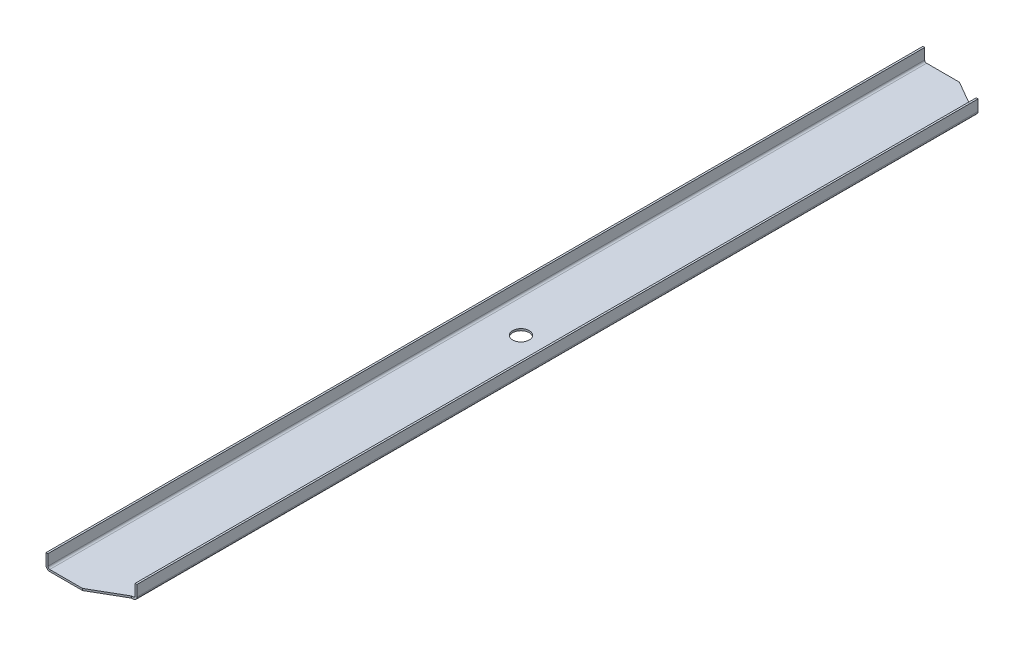
ISO-10303-21;
HEADER;
FILE_DESCRIPTION(('STEP AP214'),'2;1');
FILE_NAME('part.step','',(''),(''),'','','');
FILE_SCHEMA(('AUTOMOTIVE_DESIGN { 1 0 10303 214 1 1 1 1 }'));
ENDSEC;
DATA;
#1=APPLICATION_CONTEXT('core data for automotive mechanical design processes');
#2=APPLICATION_PROTOCOL_DEFINITION('international standard','automotive_design',2000,#1);
#3=PRODUCT_CONTEXT('',#1,'mechanical');
#4=PRODUCT('Part','Part','',(#3));
#5=PRODUCT_RELATED_PRODUCT_CATEGORY('part','',(#4));
#6=PRODUCT_DEFINITION_FORMATION('','',#4);
#7=PRODUCT_DEFINITION_CONTEXT('part definition',#1,'design');
#8=PRODUCT_DEFINITION('design','',#6,#7);
#9=PRODUCT_DEFINITION_SHAPE('','',#8);
#10=(LENGTH_UNIT() NAMED_UNIT(*) SI_UNIT(.MILLI.,.METRE.));
#11=(NAMED_UNIT(*) PLANE_ANGLE_UNIT() SI_UNIT($,.RADIAN.));
#12=(NAMED_UNIT(*) SI_UNIT($,.STERADIAN.) SOLID_ANGLE_UNIT());
#13=UNCERTAINTY_MEASURE_WITH_UNIT(LENGTH_MEASURE(1.E-05),#10,'distance_accuracy_value','');
#14=(GEOMETRIC_REPRESENTATION_CONTEXT(3) GLOBAL_UNCERTAINTY_ASSIGNED_CONTEXT((#13)) GLOBAL_UNIT_ASSIGNED_CONTEXT((#10,
#11,#12)) REPRESENTATION_CONTEXT('',''));
#15=CARTESIAN_POINT('',(0.,0.,0.));
#16=DIRECTION('',(0.,0.,1.));
#17=DIRECTION('',(1.,0.,0.));
#18=AXIS2_PLACEMENT_3D('',#15,#16,#17);
#19=CARTESIAN_POINT('',(60.2488,0.,-730.837519220438));
#20=DIRECTION('',(1.,0.,0.));
#21=DIRECTION('',(0.,0.,-1.));
#22=AXIS2_PLACEMENT_3D('',#19,#20,#21);
#23=PLANE('',#22);
#24=DIRECTION('',(0.,1.,0.));
#25=VECTOR('',#24,1.);
#26=CARTESIAN_POINT('',(60.2488,15.9512,730.837519220438));
#27=LINE('',#26,#25);
#28=CARTESIAN_POINT('',(60.2488,25.4,730.837519220438));
#29=VERTEX_POINT('',#28);
#30=CARTESIAN_POINT('',(60.2488,6.5024,730.837519220438));
#31=VERTEX_POINT('',#30);
#32=EDGE_CURVE('E96',#29,#31,#27,.F.);
#33=ORIENTED_EDGE('',*,*,#32,.F.);
#34=DIRECTION('',(0.,0.,1.));
#35=VECTOR('',#34,1.);
#36=CARTESIAN_POINT('',(60.2488,25.4,0.));
#37=LINE('',#36,#35);
#38=CARTESIAN_POINT('',(60.2488,25.4,-730.837519220438));
#39=VERTEX_POINT('',#38);
#40=EDGE_CURVE('E119',#39,#29,#37,.T.);
#41=ORIENTED_EDGE('',*,*,#40,.F.);
#42=DIRECTION('',(0.,1.,0.));
#43=VECTOR('',#42,1.);
#44=CARTESIAN_POINT('',(60.2488,15.9512,-730.837519220438));
#45=LINE('',#44,#43);
#46=CARTESIAN_POINT('',(60.2488,6.5024,-730.837519220438));
#47=VERTEX_POINT('',#46);
#48=EDGE_CURVE('E124',#47,#39,#45,.T.);
#49=ORIENTED_EDGE('',*,*,#48,.F.);
#50=DIRECTION('',(0.,0.,-1.));
#51=VECTOR('',#50,1.);
#52=CARTESIAN_POINT('',(60.2488,6.5024,730.837519220438));
#53=LINE('',#52,#51);
#54=EDGE_CURVE('E213',#47,#31,#53,.F.);
#55=ORIENTED_EDGE('',*,*,#54,.T.);
#56=EDGE_LOOP('',(#33,#41,#49,#55));
#57=FACE_BOUND('',#56,.T.);
#58=ADVANCED_FACE('F17',(#57),#23,.F.);
#59=CARTESIAN_POINT('',(-60.2488,0.,762.));
#60=DIRECTION('',(-1.,0.,0.));
#61=DIRECTION('',(0.,0.,1.));
#62=AXIS2_PLACEMENT_3D('',#59,#60,#61);
#63=PLANE('',#62);
#64=DIRECTION('',(0.,1.,0.));
#65=VECTOR('',#64,1.);
#66=CARTESIAN_POINT('',(-60.2488,15.9512,-762.));
#67=LINE('',#66,#65);
#68=CARTESIAN_POINT('',(-60.2488,25.4,-762.));
#69=VERTEX_POINT('',#68);
#70=CARTESIAN_POINT('',(-60.2488,6.5024,-762.));
#71=VERTEX_POINT('',#70);
#72=EDGE_CURVE('E216',#69,#71,#67,.F.);
#73=ORIENTED_EDGE('',*,*,#72,.F.);
#74=DIRECTION('',(0.,0.,1.));
#75=VECTOR('',#74,1.);
#76=CARTESIAN_POINT('',(-60.2488,25.4,0.));
#77=LINE('',#76,#75);
#78=CARTESIAN_POINT('',(-60.2488,25.4,762.));
#79=VERTEX_POINT('',#78);
#80=EDGE_CURVE('E139',#79,#69,#77,.F.);
#81=ORIENTED_EDGE('',*,*,#80,.F.);
#82=DIRECTION('',(0.,1.,0.));
#83=VECTOR('',#82,1.);
#84=CARTESIAN_POINT('',(-60.2488,15.9512,762.));
#85=LINE('',#84,#83);
#86=CARTESIAN_POINT('',(-60.2488,6.5024,762.));
#87=VERTEX_POINT('',#86);
#88=EDGE_CURVE('E106',#87,#79,#85,.T.);
#89=ORIENTED_EDGE('',*,*,#88,.F.);
#90=DIRECTION('',(0.,0.,1.));
#91=VECTOR('',#90,1.);
#92=CARTESIAN_POINT('',(-60.2488,6.5024,-762.));
#93=LINE('',#92,#91);
#94=EDGE_CURVE('E210',#87,#71,#93,.F.);
#95=ORIENTED_EDGE('',*,*,#94,.T.);
#96=EDGE_LOOP('',(#73,#81,#89,#95));
#97=FACE_BOUND('',#96,.T.);
#98=ADVANCED_FACE('F398',(#97),#63,.F.);
#99=CARTESIAN_POINT('',(61.8744,25.4,0.));
#100=DIRECTION('',(0.,1.,0.));
#101=DIRECTION('',(0.,0.,1.));
#102=AXIS2_PLACEMENT_3D('',#99,#100,#101);
#103=PLANE('',#102);
#104=DIRECTION('',(1.,0.,0.));
#105=VECTOR('',#104,1.);
#106=CARTESIAN_POINT('',(61.8744,25.4,730.837519220438));
#107=LINE('',#106,#105);
#108=CARTESIAN_POINT('',(63.5,25.4,730.837519220438));
#109=VERTEX_POINT('',#108);
#110=EDGE_CURVE('E134',#109,#29,#107,.F.);
#111=ORIENTED_EDGE('',*,*,#110,.F.);
#112=DIRECTION('',(0.,0.,-1.));
#113=VECTOR('',#112,1.);
#114=CARTESIAN_POINT('',(63.5,25.4,-730.837519220438));
#115=LINE('',#114,#113);
#116=CARTESIAN_POINT('',(63.5,25.4,-730.837519220438));
#117=VERTEX_POINT('',#116);
#118=EDGE_CURVE('E138',#117,#109,#115,.F.);
#119=ORIENTED_EDGE('',*,*,#118,.F.);
#120=DIRECTION('',(-1.,0.,0.));
#121=VECTOR('',#120,1.);
#122=CARTESIAN_POINT('',(61.8744,25.4,-730.837519220438));
#123=LINE('',#122,#121);
#124=EDGE_CURVE('E128',#39,#117,#123,.F.);
#125=ORIENTED_EDGE('',*,*,#124,.F.);
#126=ORIENTED_EDGE('',*,*,#40,.T.);
#127=EDGE_LOOP('',(#111,#119,#125,#126));
#128=FACE_BOUND('',#127,.T.);
#129=ADVANCED_FACE('F137',(#128),#103,.T.);
#130=CARTESIAN_POINT('',(-61.8744,25.4,0.));
#131=DIRECTION('',(0.,1.,0.));
#132=DIRECTION('',(0.,0.,1.));
#133=AXIS2_PLACEMENT_3D('',#130,#131,#132);
#134=PLANE('',#133);
#135=DIRECTION('',(-1.,0.,0.));
#136=VECTOR('',#135,1.);
#137=CARTESIAN_POINT('',(-61.8744,25.4,-762.));
#138=LINE('',#137,#136);
#139=CARTESIAN_POINT('',(-63.5,25.4,-762.));
#140=VERTEX_POINT('',#139);
#141=EDGE_CURVE('E141',#140,#69,#138,.F.);
#142=ORIENTED_EDGE('',*,*,#141,.F.);
#143=DIRECTION('',(0.,0.,1.));
#144=VECTOR('',#143,1.);
#145=CARTESIAN_POINT('',(-63.5,25.4,762.));
#146=LINE('',#145,#144);
#147=CARTESIAN_POINT('',(-63.5,25.4,762.));
#148=VERTEX_POINT('',#147);
#149=EDGE_CURVE('E184',#148,#140,#146,.F.);
#150=ORIENTED_EDGE('',*,*,#149,.F.);
#151=DIRECTION('',(1.,0.,0.));
#152=VECTOR('',#151,1.);
#153=CARTESIAN_POINT('',(-61.8744,25.4,762.));
#154=LINE('',#153,#152);
#155=EDGE_CURVE('E215',#79,#148,#154,.F.);
#156=ORIENTED_EDGE('',*,*,#155,.F.);
#157=ORIENTED_EDGE('',*,*,#80,.T.);
#158=EDGE_LOOP('',(#142,#150,#156,#157));
#159=FACE_BOUND('',#158,.T.);
#160=ADVANCED_FACE('F262',(#159),#134,.T.);
#161=CARTESIAN_POINT('',(56.9976,6.5024,730.837519220438));
#162=DIRECTION('',(0.,0.,-1.));
#163=DIRECTION('',(-1.,0.,0.));
#164=AXIS2_PLACEMENT_3D('',#161,#162,#163);
#165=CYLINDRICAL_SURFACE('',#164,3.2512);
#166=DIRECTION('',(0.,0.,1.));
#167=VECTOR('',#166,1.);
#168=CARTESIAN_POINT('',(56.9976,3.2512,0.));
#169=LINE('',#168,#167);
#170=CARTESIAN_POINT('',(56.9976,3.2512,730.837519220438));
#171=VERTEX_POINT('',#170);
#172=CARTESIAN_POINT('',(56.9976,3.2512,-730.837519220438));
#173=VERTEX_POINT('',#172);
#174=EDGE_CURVE('E181',#171,#173,#169,.F.);
#175=ORIENTED_EDGE('',*,*,#174,.F.);
#176=CARTESIAN_POINT('',(56.9976,6.5024,730.837519220438));
#177=DIRECTION('',(0.,0.,-1.));
#178=DIRECTION('',(-1.,0.,0.));
#179=AXIS2_PLACEMENT_3D('',#176,#177,#178);
#180=CIRCLE('',#179,3.2512);
#181=EDGE_CURVE('E20',#31,#171,#180,.T.);
#182=ORIENTED_EDGE('',*,*,#181,.F.);
#183=ORIENTED_EDGE('',*,*,#54,.F.);
#184=CARTESIAN_POINT('',(56.9976,6.5024,-730.837519220438));
#185=DIRECTION('',(0.,0.,-1.));
#186=DIRECTION('',(-1.,0.,0.));
#187=AXIS2_PLACEMENT_3D('',#184,#185,#186);
#188=CIRCLE('',#187,3.2512);
#189=EDGE_CURVE('E131',#47,#173,#188,.T.);
#190=ORIENTED_EDGE('',*,*,#189,.T.);
#191=EDGE_LOOP('',(#175,#182,#183,#190));
#192=FACE_BOUND('',#191,.T.);
#193=ADVANCED_FACE('F235',(#192),#165,.F.);
#194=CARTESIAN_POINT('',(-56.9976,6.5024,-762.));
#195=DIRECTION('',(0.,0.,1.));
#196=DIRECTION('',(1.,0.,0.));
#197=AXIS2_PLACEMENT_3D('',#194,#195,#196);
#198=CYLINDRICAL_SURFACE('',#197,3.2512);
#199=DIRECTION('',(0.,0.,1.));
#200=VECTOR('',#199,1.);
#201=CARTESIAN_POINT('',(-56.9976,3.2512,0.));
#202=LINE('',#201,#200);
#203=CARTESIAN_POINT('',(-56.9976,3.2512,-762.));
#204=VERTEX_POINT('',#203);
#205=CARTESIAN_POINT('',(-56.9976,3.2512,762.));
#206=VERTEX_POINT('',#205);
#207=EDGE_CURVE('E310',#204,#206,#202,.T.);
#208=ORIENTED_EDGE('',*,*,#207,.F.);
#209=CARTESIAN_POINT('',(-56.9976,6.5024,-762.));
#210=DIRECTION('',(0.,0.,1.));
#211=DIRECTION('',(1.,0.,0.));
#212=AXIS2_PLACEMENT_3D('',#209,#210,#211);
#213=CIRCLE('',#212,3.2512);
#214=EDGE_CURVE('E183',#71,#204,#213,.T.);
#215=ORIENTED_EDGE('',*,*,#214,.F.);
#216=ORIENTED_EDGE('',*,*,#94,.F.);
#217=CARTESIAN_POINT('',(-56.9976,6.5024,762.));
#218=DIRECTION('',(0.,0.,1.));
#219=DIRECTION('',(1.,0.,0.));
#220=AXIS2_PLACEMENT_3D('',#217,#218,#219);
#221=CIRCLE('',#220,3.2512);
#222=EDGE_CURVE('E178',#87,#206,#221,.T.);
#223=ORIENTED_EDGE('',*,*,#222,.T.);
#224=EDGE_LOOP('',(#208,#215,#216,#223));
#225=FACE_BOUND('',#224,.T.);
#226=ADVANCED_FACE('F347',(#225),#198,.F.);
#227=CARTESIAN_POINT('',(63.5,0.,-730.837519220438));
#228=DIRECTION('',(1.,0.,0.));
#229=DIRECTION('',(0.,0.,-1.));
#230=AXIS2_PLACEMENT_3D('',#227,#228,#229);
#231=PLANE('',#230);
#232=DIRECTION('',(0.,0.,-1.));
#233=VECTOR('',#232,1.);
#234=CARTESIAN_POINT('',(63.5,6.5024,730.837519220438));
#235=LINE('',#234,#233);
#236=CARTESIAN_POINT('',(63.5,6.5024,-730.837519220438));
#237=VERTEX_POINT('',#236);
#238=CARTESIAN_POINT('',(63.5,6.5024,730.837519220438));
#239=VERTEX_POINT('',#238);
#240=EDGE_CURVE('E174',#237,#239,#235,.F.);
#241=ORIENTED_EDGE('',*,*,#240,.F.);
#242=DIRECTION('',(0.,1.,0.));
#243=VECTOR('',#242,1.);
#244=CARTESIAN_POINT('',(63.5,0.,-730.837519220438));
#245=LINE('',#244,#243);
#246=EDGE_CURVE('E185',#237,#117,#245,.T.);
#247=ORIENTED_EDGE('',*,*,#246,.T.);
#248=ORIENTED_EDGE('',*,*,#118,.T.);
#249=DIRECTION('',(0.,1.,0.));
#250=VECTOR('',#249,1.);
#251=CARTESIAN_POINT('',(63.5,0.,730.837519220438));
#252=LINE('',#251,#250);
#253=EDGE_CURVE('E149',#109,#239,#252,.F.);
#254=ORIENTED_EDGE('',*,*,#253,.T.);
#255=EDGE_LOOP('',(#241,#247,#248,#254));
#256=FACE_BOUND('',#255,.T.);
#257=ADVANCED_FACE('F345',(#256),#231,.T.);
#258=CARTESIAN_POINT('',(-63.5,0.,762.));
#259=DIRECTION('',(-1.,0.,0.));
#260=DIRECTION('',(0.,0.,1.));
#261=AXIS2_PLACEMENT_3D('',#258,#259,#260);
#262=PLANE('',#261);
#263=DIRECTION('',(0.,0.,1.));
#264=VECTOR('',#263,1.);
#265=CARTESIAN_POINT('',(-63.5,6.5024,-762.));
#266=LINE('',#265,#264);
#267=CARTESIAN_POINT('',(-63.5,6.5024,762.));
#268=VERTEX_POINT('',#267);
#269=CARTESIAN_POINT('',(-63.5,6.5024,-762.));
#270=VERTEX_POINT('',#269);
#271=EDGE_CURVE('E168',#268,#270,#266,.F.);
#272=ORIENTED_EDGE('',*,*,#271,.F.);
#273=DIRECTION('',(0.,1.,0.));
#274=VECTOR('',#273,1.);
#275=CARTESIAN_POINT('',(-63.5,0.,762.));
#276=LINE('',#275,#274);
#277=EDGE_CURVE('E182',#268,#148,#276,.T.);
#278=ORIENTED_EDGE('',*,*,#277,.T.);
#279=ORIENTED_EDGE('',*,*,#149,.T.);
#280=DIRECTION('',(0.,1.,0.));
#281=VECTOR('',#280,1.);
#282=CARTESIAN_POINT('',(-63.5,0.,-762.));
#283=LINE('',#282,#281);
#284=EDGE_CURVE('E224',#140,#270,#283,.F.);
#285=ORIENTED_EDGE('',*,*,#284,.T.);
#286=EDGE_LOOP('',(#272,#278,#279,#285));
#287=FACE_BOUND('',#286,.T.);
#288=ADVANCED_FACE('F257',(#287),#262,.T.);
#289=CARTESIAN_POINT('',(0.,3.2512,0.));
#290=DIRECTION('',(0.,1.,0.));
#291=DIRECTION('',(0.,0.,1.));
#292=AXIS2_PLACEMENT_3D('',#289,#290,#291);
#293=PLANE('',#292);
#294=CARTESIAN_POINT('',(0.,3.2512,0.));
#295=DIRECTION('',(0.,1.,0.));
#296=DIRECTION('',(0.,0.,1.));
#297=AXIS2_PLACEMENT_3D('',#294,#295,#296);
#298=CIRCLE('',#297,14.2875);
#299=CARTESIAN_POINT('',(0.,3.2512,14.2875));
#300=VERTEX_POINT('',#299);
#301=EDGE_CURVE('E162',#300,#300,#298,.F.);
#302=ORIENTED_EDGE('',*,*,#301,.T.);
#303=EDGE_LOOP('',(#302));
#304=FACE_BOUND('',#303,.T.);
#305=DIRECTION('',(-1.,0.,0.));
#306=VECTOR('',#305,1.);
#307=CARTESIAN_POINT('',(0.,3.2512,762.));
#308=LINE('',#307,#306);
#309=CARTESIAN_POINT('',(2.20145082718837E-11,3.2512,762.000000000038));
#310=VERTEX_POINT('',#309);
#311=EDGE_CURVE('E166',#206,#310,#308,.F.);
#312=ORIENTED_EDGE('',*,*,#311,.T.);
#313=DIRECTION('',(-0.866025403784429,0.,0.500000000000017));
#314=VECTOR('',#313,1.);
#315=CARTESIAN_POINT('',(26.9875,3.2512,746.418759610346));
#316=LINE('',#315,#314);
#317=CARTESIAN_POINT('',(53.9750000000165,3.2512,730.837519220466));
#318=VERTEX_POINT('',#317);
#319=EDGE_CURVE('E209',#310,#318,#316,.F.);
#320=ORIENTED_EDGE('',*,*,#319,.T.);
#321=DIRECTION('',(1.,0.,0.));
#322=VECTOR('',#321,1.);
#323=CARTESIAN_POINT('',(58.7375,3.2512,730.837519220438));
#324=LINE('',#323,#322);
#325=EDGE_CURVE('E206',#171,#318,#324,.F.);
#326=ORIENTED_EDGE('',*,*,#325,.F.);
#327=ORIENTED_EDGE('',*,*,#174,.T.);
#328=DIRECTION('',(1.,0.,0.));
#329=VECTOR('',#328,1.);
#330=CARTESIAN_POINT('',(58.7375,3.2512,-730.837519220438));
#331=LINE('',#330,#329);
#332=CARTESIAN_POINT('',(53.975000000044,3.2512,-730.837519220514));
#333=VERTEX_POINT('',#332);
#334=EDGE_CURVE('E199',#173,#333,#331,.F.);
#335=ORIENTED_EDGE('',*,*,#334,.T.);
#336=DIRECTION('',(0.866025403784429,0.,0.500000000000017));
#337=VECTOR('',#336,1.);
#338=CARTESIAN_POINT('',(26.9875,3.2512,-746.418759610346));
#339=LINE('',#338,#337);
#340=CARTESIAN_POINT('',(1.46746041244465E-11,3.2512,-762.000000000025));
#341=VERTEX_POINT('',#340);
#342=EDGE_CURVE('E288',#333,#341,#339,.F.);
#343=ORIENTED_EDGE('',*,*,#342,.T.);
#344=DIRECTION('',(1.,0.,0.));
#345=VECTOR('',#344,1.);
#346=CARTESIAN_POINT('',(0.,3.2512,-762.));
#347=LINE('',#346,#345);
#348=EDGE_CURVE('E171',#341,#204,#347,.F.);
#349=ORIENTED_EDGE('',*,*,#348,.T.);
#350=ORIENTED_EDGE('',*,*,#207,.T.);
#351=EDGE_LOOP('',(#312,#320,#326,#327,#335,#343,#349,#350));
#352=FACE_BOUND('',#351,.T.);
#353=ADVANCED_FACE('F354',(#304,#352),#293,.T.);
#354=CARTESIAN_POINT('',(26.9875,1.6256,746.418759610346));
#355=DIRECTION('',(-0.500000000000017,0.,-0.866025403784429));
#356=DIRECTION('',(-0.866025403784429,0.,0.500000000000017));
#357=AXIS2_PLACEMENT_3D('',#354,#355,#356);
#358=PLANE('',#357);
#359=ORIENTED_EDGE('',*,*,#319,.F.);
#360=DIRECTION('',(0.,1.,0.));
#361=VECTOR('',#360,1.);
#362=CARTESIAN_POINT('',(0.,1.6256,762.));
#363=LINE('',#362,#361);
#364=CARTESIAN_POINT('',(2.20145082718837E-11,0.,762.000000000038));
#365=VERTEX_POINT('',#364);
#366=EDGE_CURVE('E319',#310,#365,#363,.F.);
#367=ORIENTED_EDGE('',*,*,#366,.T.);
#368=DIRECTION('',(0.866025403784077,0.,-0.500000000000626));
#369=VECTOR('',#368,1.);
#370=CARTESIAN_POINT('',(0.,0.,762.));
#371=LINE('',#370,#369);
#372=CARTESIAN_POINT('',(53.975000000033,0.,730.837519220495));
#373=VERTEX_POINT('',#372);
#374=EDGE_CURVE('E165',#365,#373,#371,.T.);
#375=ORIENTED_EDGE('',*,*,#374,.T.);
#376=DIRECTION('',(0.,1.,0.));
#377=VECTOR('',#376,1.);
#378=CARTESIAN_POINT('',(53.975,1.6256,730.837519220438));
#379=LINE('',#378,#377);
#380=EDGE_CURVE('E177',#318,#373,#379,.F.);
#381=ORIENTED_EDGE('',*,*,#380,.F.);
#382=EDGE_LOOP('',(#359,#367,#375,#381));
#383=FACE_BOUND('',#382,.T.);
#384=ADVANCED_FACE('F331',(#383),#358,.F.);
#385=CARTESIAN_POINT('',(58.7375,1.6256,730.837519220438));
#386=DIRECTION('',(0.,0.,1.));
#387=DIRECTION('',(1.,0.,0.));
#388=AXIS2_PLACEMENT_3D('',#385,#386,#387);
#389=PLANE('',#388);
#390=ORIENTED_EDGE('',*,*,#380,.T.);
#391=DIRECTION('',(1.,0.,0.));
#392=VECTOR('',#391,1.);
#393=CARTESIAN_POINT('',(0.,0.,730.837519220438));
#394=LINE('',#393,#392);
#395=CARTESIAN_POINT('',(56.9976,0.,730.837519220438));
#396=VERTEX_POINT('',#395);
#397=EDGE_CURVE('E203',#373,#396,#394,.T.);
#398=ORIENTED_EDGE('',*,*,#397,.T.);
#399=CARTESIAN_POINT('',(56.9976,6.5024,730.837519220438));
#400=DIRECTION('',(0.,0.,-1.));
#401=DIRECTION('',(-1.,0.,0.));
#402=AXIS2_PLACEMENT_3D('',#399,#400,#401);
#403=CIRCLE('',#402,6.5024);
#404=EDGE_CURVE('E175',#239,#396,#403,.T.);
#405=ORIENTED_EDGE('',*,*,#404,.F.);
#406=ORIENTED_EDGE('',*,*,#253,.F.);
#407=ORIENTED_EDGE('',*,*,#110,.T.);
#408=ORIENTED_EDGE('',*,*,#32,.T.);
#409=ORIENTED_EDGE('',*,*,#181,.T.);
#410=ORIENTED_EDGE('',*,*,#325,.T.);
#411=EDGE_LOOP('',(#390,#398,#405,#406,#407,#408,#409,#410));
#412=FACE_BOUND('',#411,.T.);
#413=ADVANCED_FACE('F238',(#412),#389,.T.);
#414=CARTESIAN_POINT('',(56.9976,6.5024,730.837519220438));
#415=DIRECTION('',(0.,0.,-1.));
#416=DIRECTION('',(-1.,0.,0.));
#417=AXIS2_PLACEMENT_3D('',#414,#415,#416);
#418=CYLINDRICAL_SURFACE('',#417,6.5024);
#419=CARTESIAN_POINT('',(56.9976,6.5024,-730.837519220438));
#420=DIRECTION('',(0.,0.,-1.));
#421=DIRECTION('',(-1.,0.,0.));
#422=AXIS2_PLACEMENT_3D('',#419,#420,#421);
#423=CIRCLE('',#422,6.5024);
#424=CARTESIAN_POINT('',(56.9976,0.,-730.837519220438));
#425=VERTEX_POINT('',#424);
#426=EDGE_CURVE('E172',#425,#237,#423,.F.);
#427=ORIENTED_EDGE('',*,*,#426,.T.);
#428=ORIENTED_EDGE('',*,*,#240,.T.);
#429=ORIENTED_EDGE('',*,*,#404,.T.);
#430=DIRECTION('',(0.,0.,1.));
#431=VECTOR('',#430,1.);
#432=CARTESIAN_POINT('',(56.9976,0.,0.));
#433=LINE('',#432,#431);
#434=EDGE_CURVE('E194',#396,#425,#433,.F.);
#435=ORIENTED_EDGE('',*,*,#434,.T.);
#436=EDGE_LOOP('',(#427,#428,#429,#435));
#437=FACE_BOUND('',#436,.T.);
#438=ADVANCED_FACE('F344',(#437),#418,.T.);
#439=CARTESIAN_POINT('',(58.7375,1.6256,-730.837519220438));
#440=DIRECTION('',(0.,0.,1.));
#441=DIRECTION('',(1.,0.,0.));
#442=AXIS2_PLACEMENT_3D('',#439,#440,#441);
#443=PLANE('',#442);
#444=ORIENTED_EDGE('',*,*,#334,.F.);
#445=ORIENTED_EDGE('',*,*,#189,.F.);
#446=ORIENTED_EDGE('',*,*,#48,.T.);
#447=ORIENTED_EDGE('',*,*,#124,.T.);
#448=ORIENTED_EDGE('',*,*,#246,.F.);
#449=ORIENTED_EDGE('',*,*,#426,.F.);
#450=DIRECTION('',(1.,0.,0.));
#451=VECTOR('',#450,1.);
#452=CARTESIAN_POINT('',(0.,0.,-730.837519220438));
#453=LINE('',#452,#451);
#454=CARTESIAN_POINT('',(53.975000000033,0.,-730.837519220495));
#455=VERTEX_POINT('',#454);
#456=EDGE_CURVE('E297',#425,#455,#453,.F.);
#457=ORIENTED_EDGE('',*,*,#456,.T.);
#458=DIRECTION('',(0.,1.,0.));
#459=VECTOR('',#458,1.);
#460=CARTESIAN_POINT('',(53.975000000066,1.6256,-730.837519220552));
#461=LINE('',#460,#459);
#462=EDGE_CURVE('E292',#455,#333,#461,.T.);
#463=ORIENTED_EDGE('',*,*,#462,.T.);
#464=EDGE_LOOP('',(#444,#445,#446,#447,#448,#449,#457,#463));
#465=FACE_BOUND('',#464,.T.);
#466=ADVANCED_FACE('F126',(#465),#443,.F.);
#467=CARTESIAN_POINT('',(26.9875,1.6256,-746.418759610346));
#468=DIRECTION('',(-0.500000000000017,0.,0.866025403784429));
#469=DIRECTION('',(0.866025403784429,0.,0.500000000000017));
#470=AXIS2_PLACEMENT_3D('',#467,#468,#469);
#471=PLANE('',#470);
#472=ORIENTED_EDGE('',*,*,#342,.F.);
#473=ORIENTED_EDGE('',*,*,#462,.F.);
#474=DIRECTION('',(-0.866025403784077,0.,-0.500000000000626));
#475=VECTOR('',#474,1.);
#476=CARTESIAN_POINT('',(53.975,0.,-730.837519220438));
#477=LINE('',#476,#475);
#478=CARTESIAN_POINT('',(1.10098562211558E-11,0.,-762.));
#479=VERTEX_POINT('',#478);
#480=EDGE_CURVE('E278',#455,#479,#477,.T.);
#481=ORIENTED_EDGE('',*,*,#480,.T.);
#482=DIRECTION('',(0.,1.,0.));
#483=VECTOR('',#482,1.);
#484=CARTESIAN_POINT('',(0.,1.6256,-762.));
#485=LINE('',#484,#483);
#486=EDGE_CURVE('E283',#479,#341,#485,.T.);
#487=ORIENTED_EDGE('',*,*,#486,.T.);
#488=EDGE_LOOP('',(#472,#473,#481,#487));
#489=FACE_BOUND('',#488,.T.);
#490=ADVANCED_FACE('F378',(#489),#471,.F.);
#491=CARTESIAN_POINT('',(0.,1.6256,-762.));
#492=DIRECTION('',(0.,0.,1.));
#493=DIRECTION('',(1.,0.,0.));
#494=AXIS2_PLACEMENT_3D('',#491,#492,#493);
#495=PLANE('',#494);
#496=DIRECTION('',(1.,0.,0.));
#497=VECTOR('',#496,1.);
#498=CARTESIAN_POINT('',(0.,0.,-762.));
#499=LINE('',#498,#497);
#500=CARTESIAN_POINT('',(-56.9976,0.,-762.));
#501=VERTEX_POINT('',#500);
#502=EDGE_CURVE('E275',#479,#501,#499,.F.);
#503=ORIENTED_EDGE('',*,*,#502,.T.);
#504=CARTESIAN_POINT('',(-56.9976,6.5024,-762.));
#505=DIRECTION('',(0.,0.,1.));
#506=DIRECTION('',(1.,0.,0.));
#507=AXIS2_PLACEMENT_3D('',#504,#505,#506);
#508=CIRCLE('',#507,6.5024);
#509=EDGE_CURVE('E169',#270,#501,#508,.T.);
#510=ORIENTED_EDGE('',*,*,#509,.F.);
#511=ORIENTED_EDGE('',*,*,#284,.F.);
#512=ORIENTED_EDGE('',*,*,#141,.T.);
#513=ORIENTED_EDGE('',*,*,#72,.T.);
#514=ORIENTED_EDGE('',*,*,#214,.T.);
#515=ORIENTED_EDGE('',*,*,#348,.F.);
#516=ORIENTED_EDGE('',*,*,#486,.F.);
#517=EDGE_LOOP('',(#503,#510,#511,#512,#513,#514,#515,#516));
#518=FACE_BOUND('',#517,.T.);
#519=ADVANCED_FACE('F267',(#518),#495,.F.);
#520=CARTESIAN_POINT('',(-56.9976,6.5024,-762.));
#521=DIRECTION('',(0.,0.,1.));
#522=DIRECTION('',(1.,0.,0.));
#523=AXIS2_PLACEMENT_3D('',#520,#521,#522);
#524=CYLINDRICAL_SURFACE('',#523,6.5024);
#525=CARTESIAN_POINT('',(-56.9976,6.5024,762.));
#526=DIRECTION('',(0.,0.,1.));
#527=DIRECTION('',(1.,0.,0.));
#528=AXIS2_PLACEMENT_3D('',#525,#526,#527);
#529=CIRCLE('',#528,6.5024);
#530=CARTESIAN_POINT('',(-56.9976,0.,762.));
#531=VERTEX_POINT('',#530);
#532=EDGE_CURVE('E35',#531,#268,#529,.F.);
#533=ORIENTED_EDGE('',*,*,#532,.T.);
#534=ORIENTED_EDGE('',*,*,#271,.T.);
#535=ORIENTED_EDGE('',*,*,#509,.T.);
#536=DIRECTION('',(0.,0.,1.));
#537=VECTOR('',#536,1.);
#538=CARTESIAN_POINT('',(-56.9976,0.,0.));
#539=LINE('',#538,#537);
#540=EDGE_CURVE('E277',#501,#531,#539,.T.);
#541=ORIENTED_EDGE('',*,*,#540,.T.);
#542=EDGE_LOOP('',(#533,#534,#535,#541));
#543=FACE_BOUND('',#542,.T.);
#544=ADVANCED_FACE('F372',(#543),#524,.T.);
#545=CARTESIAN_POINT('',(0.,1.6256,762.));
#546=DIRECTION('',(0.,0.,-1.));
#547=DIRECTION('',(-1.,0.,0.));
#548=AXIS2_PLACEMENT_3D('',#545,#546,#547);
#549=PLANE('',#548);
#550=ORIENTED_EDGE('',*,*,#311,.F.);
#551=ORIENTED_EDGE('',*,*,#222,.F.);
#552=ORIENTED_EDGE('',*,*,#88,.T.);
#553=ORIENTED_EDGE('',*,*,#155,.T.);
#554=ORIENTED_EDGE('',*,*,#277,.F.);
#555=ORIENTED_EDGE('',*,*,#532,.F.);
#556=DIRECTION('',(1.,0.,0.));
#557=VECTOR('',#556,1.);
#558=CARTESIAN_POINT('',(0.,0.,762.));
#559=LINE('',#558,#557);
#560=EDGE_CURVE('E26',#531,#365,#559,.T.);
#561=ORIENTED_EDGE('',*,*,#560,.T.);
#562=ORIENTED_EDGE('',*,*,#366,.F.);
#563=EDGE_LOOP('',(#550,#551,#552,#553,#554,#555,#561,#562));
#564=FACE_BOUND('',#563,.T.);
#565=ADVANCED_FACE('F365',(#564),#549,.F.);
#566=CARTESIAN_POINT('',(0.,1.6256,0.));
#567=DIRECTION('',(0.,1.,0.));
#568=DIRECTION('',(0.,0.,1.));
#569=AXIS2_PLACEMENT_3D('',#566,#567,#568);
#570=CYLINDRICAL_SURFACE('',#569,14.2875);
#571=ORIENTED_EDGE('',*,*,#301,.F.);
#572=EDGE_LOOP('',(#571));
#573=FACE_BOUND('',#572,.T.);
#574=CARTESIAN_POINT('',(0.,0.,0.));
#575=DIRECTION('',(0.,1.,0.));
#576=DIRECTION('',(0.,0.,1.));
#577=AXIS2_PLACEMENT_3D('',#574,#575,#576);
#578=CIRCLE('',#577,14.2875);
#579=CARTESIAN_POINT('',(0.,0.,14.2875));
#580=VERTEX_POINT('',#579);
#581=EDGE_CURVE('E11',#580,#580,#578,.F.);
#582=ORIENTED_EDGE('',*,*,#581,.T.);
#583=EDGE_LOOP('',(#582));
#584=FACE_BOUND('',#583,.T.);
#585=ADVANCED_FACE('F359',(#573,#584),#570,.F.);
#586=CARTESIAN_POINT('',(0.,0.,0.));
#587=DIRECTION('',(0.,1.,0.));
#588=DIRECTION('',(0.,0.,1.));
#589=AXIS2_PLACEMENT_3D('',#586,#587,#588);
#590=PLANE('',#589);
#591=ORIENTED_EDGE('',*,*,#581,.F.);
#592=EDGE_LOOP('',(#591));
#593=FACE_BOUND('',#592,.T.);
#594=ORIENTED_EDGE('',*,*,#540,.F.);
#595=ORIENTED_EDGE('',*,*,#502,.F.);
#596=ORIENTED_EDGE('',*,*,#480,.F.);
#597=ORIENTED_EDGE('',*,*,#456,.F.);
#598=ORIENTED_EDGE('',*,*,#434,.F.);
#599=ORIENTED_EDGE('',*,*,#397,.F.);
#600=ORIENTED_EDGE('',*,*,#374,.F.);
#601=ORIENTED_EDGE('',*,*,#560,.F.);
#602=EDGE_LOOP('',(#594,#595,#596,#597,#598,#599,#600,#601));
#603=FACE_BOUND('',#602,.T.);
#604=ADVANCED_FACE('F336',(#593,#603),#590,.F.);
#605=CLOSED_SHELL('',(#58,#98,#129,#160,#193,#226,#257,#288,#353,#384,#413,#438,#466,#490,#519,
#544,#565,#585,#604));
#606=MANIFOLD_SOLID_BREP('B1',#605);
#607=ADVANCED_BREP_SHAPE_REPRESENTATION('',(#18,#606),#14);
#608=SHAPE_DEFINITION_REPRESENTATION(#9,#607);
ENDSEC;
END-ISO-10303-21;
